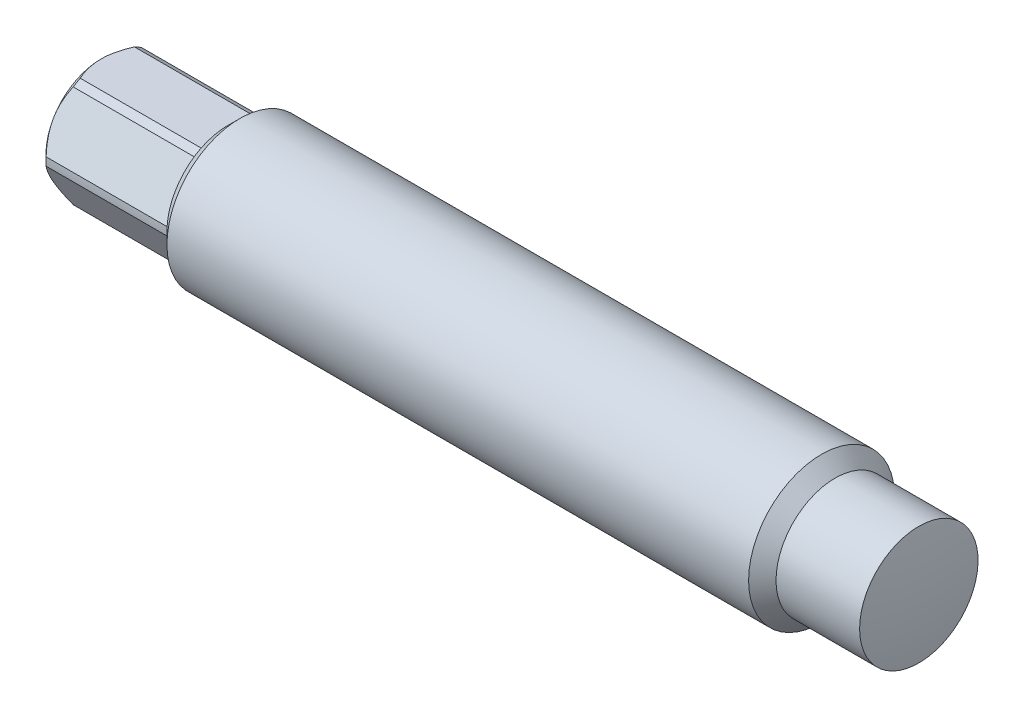
ISO-10303-21;
HEADER;
FILE_DESCRIPTION(('STEP AP214'),'2;1');
FILE_NAME('part.step','',(''),(''),'','','');
FILE_SCHEMA(('AUTOMOTIVE_DESIGN { 1 0 10303 214 1 1 1 1 }'));
ENDSEC;
DATA;
#1=APPLICATION_CONTEXT('core data for automotive mechanical design processes');
#2=APPLICATION_PROTOCOL_DEFINITION('international standard','automotive_design',2000,#1);
#3=PRODUCT_CONTEXT('',#1,'mechanical');
#4=PRODUCT('Part','Part','',(#3));
#5=PRODUCT_RELATED_PRODUCT_CATEGORY('part','',(#4));
#6=PRODUCT_DEFINITION_FORMATION('','',#4);
#7=PRODUCT_DEFINITION_CONTEXT('part definition',#1,'design');
#8=PRODUCT_DEFINITION('design','',#6,#7);
#9=PRODUCT_DEFINITION_SHAPE('','',#8);
#10=(LENGTH_UNIT() NAMED_UNIT(*) SI_UNIT(.MILLI.,.METRE.));
#11=(NAMED_UNIT(*) PLANE_ANGLE_UNIT() SI_UNIT($,.RADIAN.));
#12=(NAMED_UNIT(*) SI_UNIT($,.STERADIAN.) SOLID_ANGLE_UNIT());
#13=UNCERTAINTY_MEASURE_WITH_UNIT(LENGTH_MEASURE(1.E-05),#10,'distance_accuracy_value','');
#14=(GEOMETRIC_REPRESENTATION_CONTEXT(3) GLOBAL_UNCERTAINTY_ASSIGNED_CONTEXT((#13)) GLOBAL_UNIT_ASSIGNED_CONTEXT((#10,
#11,#12)) REPRESENTATION_CONTEXT('',''));
#15=CARTESIAN_POINT('',(0.,0.,0.));
#16=DIRECTION('',(0.,0.,1.));
#17=DIRECTION('',(1.,0.,0.));
#18=AXIS2_PLACEMENT_3D('',#15,#16,#17);
#19=CARTESIAN_POINT('',(0.,0.,0.));
#20=DIRECTION('',(-1.,0.,0.));
#21=DIRECTION('',(0.,0.,1.));
#22=AXIS2_PLACEMENT_3D('',#19,#20,#21);
#23=CYLINDRICAL_SURFACE('',#22,7.9629);
#24=DIRECTION('',(-1.,0.,0.));
#25=VECTOR('',#24,1.);
#26=CARTESIAN_POINT('',(0.,0.525408315359418,-7.94554733873955));
#27=LINE('',#26,#25);
#28=CARTESIAN_POINT('',(-90.17,0.525408315359418,-7.94554733873955));
#29=VERTEX_POINT('',#28);
#30=CARTESIAN_POINT('',(-105.86085,0.525408315359419,-7.94554733873955));
#31=VERTEX_POINT('',#30);
#32=EDGE_CURVE('E447',#29,#31,#27,.T.);
#33=ORIENTED_EDGE('',*,*,#32,.F.);
#34=CARTESIAN_POINT('',(-90.17,0.,0.));
#35=DIRECTION('',(-1.,0.,0.));
#36=DIRECTION('',(0.,0.,1.));
#37=AXIS2_PLACEMENT_3D('',#34,#35,#36);
#38=CIRCLE('',#37,7.9629);
#39=CARTESIAN_POINT('',(-90.17,-0.525408315359413,-7.94554733873955));
#40=VERTEX_POINT('',#39);
#41=EDGE_CURVE('E559',#29,#40,#38,.T.);
#42=ORIENTED_EDGE('',*,*,#41,.T.);
#43=DIRECTION('',(-1.,0.,0.));
#44=VECTOR('',#43,1.);
#45=CARTESIAN_POINT('',(0.,-0.525408315359413,-7.94554733873955));
#46=LINE('',#45,#44);
#47=CARTESIAN_POINT('',(-105.86085,-0.525408315359416,-7.94554733873955));
#48=VERTEX_POINT('',#47);
#49=EDGE_CURVE('E405',#48,#40,#46,.F.);
#50=ORIENTED_EDGE('',*,*,#49,.F.);
#51=CARTESIAN_POINT('',(-105.86085,0.,0.));
#52=DIRECTION('',(-1.,0.,0.));
#53=DIRECTION('',(0.,0.,1.));
#54=AXIS2_PLACEMENT_3D('',#51,#52,#53);
#55=CIRCLE('',#54,7.9629);
#56=EDGE_CURVE('E487',#31,#48,#55,.T.);
#57=ORIENTED_EDGE('',*,*,#56,.F.);
#58=EDGE_LOOP('',(#33,#42,#50,#57));
#59=FACE_BOUND('',#58,.T.);
#60=ADVANCED_FACE('F140',(#59),#23,.T.);
#61=DIRECTION('',(-1.,0.,0.));
#62=VECTOR('',#61,1.);
#63=CARTESIAN_POINT('',(0.,6.61834168464059,-4.42779061783062));
#64=LINE('',#63,#62);
#65=CARTESIAN_POINT('',(-105.86085,6.61834168464058,-4.42779061783062));
#66=VERTEX_POINT('',#65);
#67=CARTESIAN_POINT('',(-90.17,6.61834168464059,-4.42779061783061));
#68=VERTEX_POINT('',#67);
#69=EDGE_CURVE('E444',#66,#68,#64,.F.);
#70=ORIENTED_EDGE('',*,*,#69,.F.);
#71=CARTESIAN_POINT('',(-105.86085,7.14375,-3.51775672090893));
#72=VERTEX_POINT('',#71);
#73=EDGE_CURVE('E591',#72,#66,#55,.T.);
#74=ORIENTED_EDGE('',*,*,#73,.F.);
#75=DIRECTION('',(-1.,0.,0.));
#76=VECTOR('',#75,1.);
#77=CARTESIAN_POINT('',(0.,7.14375,-3.51775672090893));
#78=LINE('',#77,#76);
#79=CARTESIAN_POINT('',(-90.17,7.14375,-3.51775672090893));
#80=VERTEX_POINT('',#79);
#81=EDGE_CURVE('E507',#80,#72,#78,.T.);
#82=ORIENTED_EDGE('',*,*,#81,.F.);
#83=EDGE_CURVE('E320',#80,#68,#38,.T.);
#84=ORIENTED_EDGE('',*,*,#83,.T.);
#85=EDGE_LOOP('',(#70,#74,#82,#84));
#86=FACE_BOUND('',#85,.T.);
#87=ADVANCED_FACE('F262',(#86),#23,.T.);
#88=DIRECTION('',(-1.,0.,0.));
#89=VECTOR('',#88,1.);
#90=CARTESIAN_POINT('',(0.,-6.61834168464058,-4.42779061783062));
#91=LINE('',#90,#89);
#92=CARTESIAN_POINT('',(-90.17,-6.61834168464058,-4.42779061783062));
#93=VERTEX_POINT('',#92);
#94=CARTESIAN_POINT('',(-105.86085,-6.61834168464058,-4.42779061783062));
#95=VERTEX_POINT('',#94);
#96=EDGE_CURVE('E443',#93,#95,#91,.T.);
#97=ORIENTED_EDGE('',*,*,#96,.F.);
#98=CARTESIAN_POINT('',(-90.17,-7.14375,-3.51775672090893));
#99=VERTEX_POINT('',#98);
#100=EDGE_CURVE('E560',#93,#99,#38,.T.);
#101=ORIENTED_EDGE('',*,*,#100,.T.);
#102=DIRECTION('',(-1.,0.,0.));
#103=VECTOR('',#102,1.);
#104=CARTESIAN_POINT('',(0.,-7.14375,-3.51775672090893));
#105=LINE('',#104,#103);
#106=CARTESIAN_POINT('',(-105.86085,-7.14375,-3.51775672090893));
#107=VERTEX_POINT('',#106);
#108=EDGE_CURVE('E600',#107,#99,#105,.F.);
#109=ORIENTED_EDGE('',*,*,#108,.F.);
#110=EDGE_CURVE('E494',#95,#107,#55,.T.);
#111=ORIENTED_EDGE('',*,*,#110,.F.);
#112=EDGE_LOOP('',(#97,#101,#109,#111));
#113=FACE_BOUND('',#112,.T.);
#114=ADVANCED_FACE('F269',(#113),#23,.T.);
#115=DIRECTION('',(-1.,0.,0.));
#116=VECTOR('',#115,1.);
#117=CARTESIAN_POINT('',(0.,-7.14375,3.51775672090893));
#118=LINE('',#117,#116);
#119=CARTESIAN_POINT('',(-90.17,-7.14375,3.51775672090893));
#120=VERTEX_POINT('',#119);
#121=CARTESIAN_POINT('',(-105.86085,-7.14375,3.51775672090893));
#122=VERTEX_POINT('',#121);
#123=EDGE_CURVE('E404',#120,#122,#118,.T.);
#124=ORIENTED_EDGE('',*,*,#123,.F.);
#125=CARTESIAN_POINT('',(-90.17,-6.61834168464058,4.42779061783062));
#126=VERTEX_POINT('',#125);
#127=EDGE_CURVE('E572',#120,#126,#38,.T.);
#128=ORIENTED_EDGE('',*,*,#127,.T.);
#129=DIRECTION('',(-1.,0.,0.));
#130=VECTOR('',#129,1.);
#131=CARTESIAN_POINT('',(0.,-6.61834168464059,4.42779061783061));
#132=LINE('',#131,#130);
#133=CARTESIAN_POINT('',(-105.86085,-6.61834168464058,4.42779061783062));
#134=VERTEX_POINT('',#133);
#135=EDGE_CURVE('E609',#134,#126,#132,.F.);
#136=ORIENTED_EDGE('',*,*,#135,.F.);
#137=EDGE_CURVE('E462',#122,#134,#55,.T.);
#138=ORIENTED_EDGE('',*,*,#137,.F.);
#139=EDGE_LOOP('',(#124,#128,#136,#138));
#140=FACE_BOUND('',#139,.T.);
#141=ADVANCED_FACE('F285',(#140),#23,.T.);
#142=DIRECTION('',(-1.,0.,0.));
#143=VECTOR('',#142,1.);
#144=CARTESIAN_POINT('',(0.,-0.52540831535942,7.94554733873955));
#145=LINE('',#144,#143);
#146=CARTESIAN_POINT('',(-90.17,-0.52540831535942,7.94554733873955));
#147=VERTEX_POINT('',#146);
#148=CARTESIAN_POINT('',(-105.86085,-0.525408315359425,7.94554733873955));
#149=VERTEX_POINT('',#148);
#150=EDGE_CURVE('E497',#147,#149,#145,.T.);
#151=ORIENTED_EDGE('',*,*,#150,.F.);
#152=CARTESIAN_POINT('',(-90.17,0.525408315359412,7.94554733873955));
#153=VERTEX_POINT('',#152);
#154=EDGE_CURVE('E318',#147,#153,#38,.T.);
#155=ORIENTED_EDGE('',*,*,#154,.T.);
#156=DIRECTION('',(-1.,0.,0.));
#157=VECTOR('',#156,1.);
#158=CARTESIAN_POINT('',(0.,0.525408315359413,7.94554733873955));
#159=LINE('',#158,#157);
#160=CARTESIAN_POINT('',(-105.86085,0.525408315359416,7.94554733873955));
#161=VERTEX_POINT('',#160);
#162=EDGE_CURVE('E301',#161,#153,#159,.F.);
#163=ORIENTED_EDGE('',*,*,#162,.F.);
#164=EDGE_CURVE('E323',#149,#161,#55,.T.);
#165=ORIENTED_EDGE('',*,*,#164,.F.);
#166=EDGE_LOOP('',(#151,#155,#163,#165));
#167=FACE_BOUND('',#166,.T.);
#168=ADVANCED_FACE('F276',(#167),#23,.T.);
#169=DIRECTION('',(-1.,0.,0.));
#170=VECTOR('',#169,1.);
#171=CARTESIAN_POINT('',(0.,6.61834168464058,4.42779061783062));
#172=LINE('',#171,#170);
#173=CARTESIAN_POINT('',(-90.17,6.61834168464058,4.42779061783062));
#174=VERTEX_POINT('',#173);
#175=CARTESIAN_POINT('',(-105.86085,6.61834168464058,4.42779061783062));
#176=VERTEX_POINT('',#175);
#177=EDGE_CURVE('E290',#174,#176,#172,.T.);
#178=ORIENTED_EDGE('',*,*,#177,.F.);
#179=CARTESIAN_POINT('',(-90.17,7.14375,3.51775672090894));
#180=VERTEX_POINT('',#179);
#181=EDGE_CURVE('E293',#174,#180,#38,.T.);
#182=ORIENTED_EDGE('',*,*,#181,.T.);
#183=DIRECTION('',(-1.,0.,0.));
#184=VECTOR('',#183,1.);
#185=CARTESIAN_POINT('',(0.,7.14375,3.51775672090894));
#186=LINE('',#185,#184);
#187=CARTESIAN_POINT('',(-105.86085,7.14375,3.51775672090893));
#188=VERTEX_POINT('',#187);
#189=EDGE_CURVE('E510',#188,#180,#186,.F.);
#190=ORIENTED_EDGE('',*,*,#189,.F.);
#191=EDGE_CURVE('E295',#176,#188,#55,.T.);
#192=ORIENTED_EDGE('',*,*,#191,.F.);
#193=EDGE_LOOP('',(#178,#182,#190,#192));
#194=FACE_BOUND('',#193,.T.);
#195=ADVANCED_FACE('F265',(#194),#23,.T.);
#196=CARTESIAN_POINT('',(-105.86085,0.,0.));
#197=DIRECTION('',(1.,0.,0.));
#198=DIRECTION('',(0.,0.,-1.));
#199=AXIS2_PLACEMENT_3D('',#196,#197,#198);
#200=CONICAL_SURFACE('',#199,7.9629,0.785398163397461);
#201=CARTESIAN_POINT('',(-105.86065,0.525016263428014,-7.94577369002768));
#202=CARTESIAN_POINT('',(-105.971804415198,0.742930623682568,-7.81996077547443));
#203=CARTESIAN_POINT('',(-106.075105204488,0.964184339123071,-7.69221988330565));
#204=CARTESIAN_POINT('',(-106.261743657902,1.41379841676234,-7.43263507454918));
#205=CARTESIAN_POINT('',(-106.345005757468,1.64218212022255,-7.3007776818779));
#206=CARTESIAN_POINT('',(-106.485597433242,2.10217965773807,-7.03519797976675));
#207=CARTESIAN_POINT('',(-106.543216246783,2.33372542458197,-6.9015149689497));
#208=CARTESIAN_POINT('',(-106.629593957802,2.80054908186164,-6.6319942047552));
#209=CARTESIAN_POINT('',(-106.65839712059,3.03582068225016,-6.49616008293822));
#210=CARTESIAN_POINT('',(-106.683921072651,3.49195676739485,-6.23280979139283));
#211=CARTESIAN_POINT('',(-106.682652186831,3.71273636675249,-6.10534263027212));
#212=CARTESIAN_POINT('',(-106.653044689095,4.15301733098721,-5.85114629705213));
#213=CARTESIAN_POINT('',(-106.624692243303,4.37251798494867,-5.72441753540018));
#214=CARTESIAN_POINT('',(-106.543055697869,4.80787693861962,-5.47306292630415));
#215=CARTESIAN_POINT('',(-106.48977788479,5.02373614254429,-5.34843655681118));
#216=CARTESIAN_POINT('',(-106.361670596268,5.45060888959126,-5.1019814613939));
#217=CARTESIAN_POINT('',(-106.286833918402,5.66162078783759,-4.98015368513917));
#218=CARTESIAN_POINT('',(-106.152029193113,5.99691143466546,-4.78657353993633));
#219=CARTESIAN_POINT('',(-106.097647524188,6.12291675321138,-4.71382433535452));
#220=CARTESIAN_POINT('',(-105.983222419549,6.37251397608516,-4.56971931153936));
#221=CARTESIAN_POINT('',(-105.923198000013,6.49611240394659,-4.49835972594215));
#222=CARTESIAN_POINT('',(-105.86065,6.61873373657199,-4.42756426654248));
#223=B_SPLINE_CURVE_WITH_KNOTS('',3,(#201,#202,#203,#204,#205,#206,#207,#208,#209,#210,#211,
#212,#213,#214,#215,#216,#217,#218,#219,#220,#221,#222),.UNSPECIFIED.,.F.,.F.,(4,2,2,2,2,2,2,2,
2,2,4),(0.,0.825650289024538,1.65436690781132,2.47348340243982,3.29133966599778,
4.05468625055734,4.81842294969002,5.58196712639048,6.34576668564924,6.81164078022065,
7.2759976065092),.UNSPECIFIED.);
#224=CARTESIAN_POINT('',(-106.68,3.571875,-6.18666897828508));
#225=VERTEX_POINT('',#224);
#226=EDGE_CURVE('E442',#31,#225,#223,.T.);
#227=ORIENTED_EDGE('',*,*,#226,.F.);
#228=ORIENTED_EDGE('',*,*,#56,.T.);
#229=CARTESIAN_POINT('',(-105.86065,-6.61873373657199,-4.42756426654249));
#230=CARTESIAN_POINT('',(-105.971804415198,-6.40081937631743,-4.55337718109574));
#231=CARTESIAN_POINT('',(-106.075105204488,-6.17956566087693,-4.68111807326452));
#232=CARTESIAN_POINT('',(-106.261743657902,-5.72995158323766,-4.94070288202099));
#233=CARTESIAN_POINT('',(-106.345005757468,-5.50156787977744,-5.07256027469227));
#234=CARTESIAN_POINT('',(-106.485597433242,-5.04157034226193,-5.33813997680342));
#235=CARTESIAN_POINT('',(-106.543216246783,-4.81002457541803,-5.47182298762046));
#236=CARTESIAN_POINT('',(-106.629593957802,-4.34320091813836,-5.74134375181496));
#237=CARTESIAN_POINT('',(-106.65839712059,-4.10792931774985,-5.87717787363195));
#238=CARTESIAN_POINT('',(-106.683921072651,-3.65179323260515,-6.14052816517734));
#239=CARTESIAN_POINT('',(-106.682652186831,-3.43101363324751,-6.26799532629805));
#240=CARTESIAN_POINT('',(-106.653044689095,-2.99073266901279,-6.52219165951803));
#241=CARTESIAN_POINT('',(-106.624692243303,-2.77123201505133,-6.64892042116998));
#242=CARTESIAN_POINT('',(-106.543055697869,-2.33587306138038,-6.90027503026602));
#243=CARTESIAN_POINT('',(-106.48977788479,-2.12001385745571,-7.02490139975899));
#244=CARTESIAN_POINT('',(-106.361670596268,-1.69314111040874,-7.27135649517627));
#245=CARTESIAN_POINT('',(-106.286833918402,-1.48212921216241,-7.393184271431));
#246=CARTESIAN_POINT('',(-106.152029193113,-1.14683856533454,-7.58676441663384));
#247=CARTESIAN_POINT('',(-106.097647524188,-1.02083324678862,-7.65951362121565));
#248=CARTESIAN_POINT('',(-105.983222419549,-0.771236023914839,-7.80361864503081));
#249=CARTESIAN_POINT('',(-105.923198000013,-0.647637596053409,-7.87497823062802));
#250=CARTESIAN_POINT('',(-105.86065,-0.525016263428011,-7.94577369002768));
#251=B_SPLINE_CURVE_WITH_KNOTS('',3,(#229,#230,#231,#232,#233,#234,#235,#236,#237,#238,#239,
#240,#241,#242,#243,#244,#245,#246,#247,#248,#249,#250),.UNSPECIFIED.,.F.,.F.,(4,2,2,2,2,2,2,2,
2,2,4),(0.,0.825650289024538,1.65436690781132,2.47348340243982,3.29133966599777,
4.05468625055733,4.81842294969001,5.58196712639047,6.34576668564924,6.81164078022065,
7.2759976065092),.UNSPECIFIED.);
#252=CARTESIAN_POINT('',(-106.68,-3.571875,-6.18666897828509));
#253=VERTEX_POINT('',#252);
#254=EDGE_CURVE('E395',#253,#48,#251,.T.);
#255=ORIENTED_EDGE('',*,*,#254,.F.);
#256=CARTESIAN_POINT('',(-106.68,0.,0.));
#257=DIRECTION('',(-1.,0.,0.));
#258=DIRECTION('',(0.,0.,1.));
#259=AXIS2_PLACEMENT_3D('',#256,#257,#258);
#260=CIRCLE('',#259,7.14375);
#261=EDGE_CURVE('E464',#225,#253,#260,.T.);
#262=ORIENTED_EDGE('',*,*,#261,.F.);
#263=EDGE_LOOP('',(#227,#228,#255,#262));
#264=FACE_BOUND('',#263,.T.);
#265=ADVANCED_FACE('F275',(#264),#200,.T.);
#266=EDGE_CURVE('E436',#225,#66,#223,.T.);
#267=ORIENTED_EDGE('',*,*,#266,.F.);
#268=CARTESIAN_POINT('',(-106.68,7.14375,0.));
#269=VERTEX_POINT('',#268);
#270=EDGE_CURVE('E453',#269,#225,#260,.T.);
#271=ORIENTED_EDGE('',*,*,#270,.F.);
#272=CARTESIAN_POINT('',(-102.726299392836,7.14375,-8.49236397688784));
#273=CARTESIAN_POINT('',(-102.883617338796,7.14375,-8.28674139122919));
#274=CARTESIAN_POINT('',(-103.039493475246,7.14375,-8.07999790427711));
#275=CARTESIAN_POINT('',(-103.347707304941,7.14375,-7.66381570002558));
#276=CARTESIAN_POINT('',(-103.500044137052,7.14375,-7.45437634567462));
#277=CARTESIAN_POINT('',(-103.801608790406,7.14375,-7.03081738792425));
#278=CARTESIAN_POINT('',(-103.950803489898,7.14375,-6.81667412436506));
#279=CARTESIAN_POINT('',(-104.243891616,7.14375,-6.38480162656461));
#280=CARTESIAN_POINT('',(-104.387785410254,7.14375,-6.16707264253182));
#281=CARTESIAN_POINT('',(-104.677724037695,7.14375,-5.71391329627827));
#282=CARTESIAN_POINT('',(-104.823356737556,7.14375,-5.4782179098306));
#283=CARTESIAN_POINT('',(-105.105425465621,7.14375,-5.00130040543057));
#284=CARTESIAN_POINT('',(-105.241859973077,7.14375,-4.76007738237876));
#285=CARTESIAN_POINT('',(-105.502615120606,7.14375,-4.27206494883061));
#286=CARTESIAN_POINT('',(-105.626971349768,7.14375,-4.02529470427702));
#287=CARTESIAN_POINT('',(-105.860784253999,7.14375,-3.52484984602448));
#288=CARTESIAN_POINT('',(-105.970247875142,7.14375,-3.27117851777284));
#289=CARTESIAN_POINT('',(-106.160980925681,7.14375,-2.78047536178263));
#290=CARTESIAN_POINT('',(-106.243928874919,7.14375,-2.54410269811936));
#291=CARTESIAN_POINT('',(-106.390893815781,7.14375,-2.06543348056348));
#292=CARTESIAN_POINT('',(-106.454909574167,7.14375,-1.82313654187762));
#293=CARTESIAN_POINT('',(-106.559516333783,7.14375,-1.33822768036744));
#294=CARTESIAN_POINT('',(-106.600525477284,7.14375,-1.09570748832519));
#295=CARTESIAN_POINT('',(-106.658280246525,7.14375,-0.607779158346964));
#296=CARTESIAN_POINT('',(-106.6750306344,7.14375,-0.362371596756799));
#297=CARTESIAN_POINT('',(-106.682895179625,7.14375,0.118700703890408));
#298=CARTESIAN_POINT('',(-106.675040482563,7.14375,0.354348823766971));
#299=CARTESIAN_POINT('',(-106.636470444818,7.14375,0.823754077859267));
#300=CARTESIAN_POINT('',(-106.605752981671,7.14375,1.0575110344722));
#301=CARTESIAN_POINT('',(-106.522653787919,7.14375,1.52540023600976));
#302=CARTESIAN_POINT('',(-106.469893761324,7.14375,1.75946416527905));
#303=CARTESIAN_POINT('',(-106.345602372319,7.14375,2.22245527996901));
#304=CARTESIAN_POINT('',(-106.274072231029,7.14375,2.45138279849576));
#305=CARTESIAN_POINT('',(-106.109955685496,7.14375,2.91901149489557));
#306=CARTESIAN_POINT('',(-106.016270341144,7.14375,3.15732272502102));
#307=CARTESIAN_POINT('',(-105.81444916461,7.14375,3.62779989607413));
#308=CARTESIAN_POINT('',(-105.706306757059,7.14375,3.85996298279215));
#309=CARTESIAN_POINT('',(-105.478137998848,7.14375,4.31925043476694));
#310=CARTESIAN_POINT('',(-105.358074843476,7.14375,4.54635636666597));
#311=CARTESIAN_POINT('',(-105.108709892512,7.14375,4.99535840255166));
#312=CARTESIAN_POINT('',(-104.979409532092,7.14375,5.21725530877127));
#313=CARTESIAN_POINT('',(-104.719957364376,7.14375,5.64565874179973));
#314=CARTESIAN_POINT('',(-104.590164125865,7.14375,5.85238358016881));
#315=CARTESIAN_POINT('',(-104.32507005428,7.14375,6.26228218078482));
#316=CARTESIAN_POINT('',(-104.189768807037,7.14375,6.46545567434368));
#317=CARTESIAN_POINT('',(-103.915747385072,7.14375,6.86707880546117));
#318=CARTESIAN_POINT('',(-103.777063527275,7.14375,7.06555331083476));
#319=CARTESIAN_POINT('',(-103.49599105997,7.14375,7.4597821335156));
#320=CARTESIAN_POINT('',(-103.353603481768,7.14375,7.65553718525368));
#321=CARTESIAN_POINT('',(-103.209700334836,7.14375,7.85015198783304));
#322=B_SPLINE_CURVE_WITH_KNOTS('',3,(#272,#273,#274,#275,#276,#277,#278,#279,#280,#281,#282,
#283,#284,#285,#286,#287,#288,#289,#290,#291,#292,#293,#294,#295,#296,#297,#298,#299,#300,#301,
#302,#303,#304,#305,#306,#307,#308,#309,#310,#311,#312,#313,#314,#315,#316,#317,#318,#319,#320,
#321),.UNSPECIFIED.,.F.,.F.,(4,2,2,2,2,2,2,2,2,2,2,2,2,2,2,2,2,2,2,2,2,2,2,2,4),(0.,
0.776716744527418,1.55362053082313,2.33652786832875,3.11938080478742,3.95038825490385,
4.78153276109287,5.61014883456512,6.43837709783569,7.18923870385181,7.94014921003845,
8.67692892985789,9.41356399590167,10.1197474747915,10.8259965203448,11.5448993680387,
12.2637554579541,13.0313587325021,13.799312324197,14.5697153723541,15.3399989831765,
16.0721759070361,16.8044079883228,17.5307421089012,18.2568761012589),.UNSPECIFIED.);
#323=EDGE_CURVE('E516',#72,#269,#322,.T.);
#324=ORIENTED_EDGE('',*,*,#323,.F.);
#325=ORIENTED_EDGE('',*,*,#73,.T.);
#326=EDGE_LOOP('',(#267,#271,#324,#325));
#327=FACE_BOUND('',#326,.T.);
#328=ADVANCED_FACE('F282',(#327),#200,.T.);
#329=EDGE_CURVE('E403',#95,#253,#251,.T.);
#330=ORIENTED_EDGE('',*,*,#329,.F.);
#331=ORIENTED_EDGE('',*,*,#110,.T.);
#332=CARTESIAN_POINT('',(-102.726299392836,-7.14375,-8.49236397688784));
#333=CARTESIAN_POINT('',(-102.883617338796,-7.14375,-8.28674139122919));
#334=CARTESIAN_POINT('',(-103.039493475246,-7.14375,-8.0799979042771));
#335=CARTESIAN_POINT('',(-103.347707304941,-7.14375,-7.66381570002557));
#336=CARTESIAN_POINT('',(-103.500044137052,-7.14375,-7.45437634567462));
#337=CARTESIAN_POINT('',(-103.801608790406,-7.14375,-7.03081738792425));
#338=CARTESIAN_POINT('',(-103.950803489898,-7.14375,-6.81667412436505));
#339=CARTESIAN_POINT('',(-104.243891616,-7.14375,-6.38480162656461));
#340=CARTESIAN_POINT('',(-104.387785410254,-7.14375,-6.16707264253182));
#341=CARTESIAN_POINT('',(-104.677724037695,-7.14375,-5.71391329627827));
#342=CARTESIAN_POINT('',(-104.823356737556,-7.14375,-5.47821790983061));
#343=CARTESIAN_POINT('',(-105.105425465621,-7.14375,-5.00130040543057));
#344=CARTESIAN_POINT('',(-105.241859973077,-7.14375,-4.76007738237876));
#345=CARTESIAN_POINT('',(-105.502615120606,-7.14375,-4.2720649488306));
#346=CARTESIAN_POINT('',(-105.626971349768,-7.14375,-4.02529470427702));
#347=CARTESIAN_POINT('',(-105.860784253999,-7.14375,-3.52484984602447));
#348=CARTESIAN_POINT('',(-105.970247875142,-7.14375,-3.27117851777284));
#349=CARTESIAN_POINT('',(-106.160980925681,-7.14375,-2.78047536178263));
#350=CARTESIAN_POINT('',(-106.243928874919,-7.14375,-2.54410269811936));
#351=CARTESIAN_POINT('',(-106.390893815781,-7.14375,-2.06543348056348));
#352=CARTESIAN_POINT('',(-106.454909574167,-7.14375,-1.82313654187761));
#353=CARTESIAN_POINT('',(-106.559516333783,-7.14375,-1.33822768036744));
#354=CARTESIAN_POINT('',(-106.600525477284,-7.14375,-1.09570748832519));
#355=CARTESIAN_POINT('',(-106.658280246525,-7.14375,-0.607779158346961));
#356=CARTESIAN_POINT('',(-106.6750306344,-7.14375,-0.362371596756795));
#357=CARTESIAN_POINT('',(-106.682895179625,-7.14375,0.118700703890413));
#358=CARTESIAN_POINT('',(-106.675040482563,-7.14375,0.354348823766977));
#359=CARTESIAN_POINT('',(-106.636470444818,-7.14375,0.823754077859274));
#360=CARTESIAN_POINT('',(-106.605752981671,-7.14375,1.05751103447221));
#361=CARTESIAN_POINT('',(-106.522653787919,-7.14375,1.52540023600977));
#362=CARTESIAN_POINT('',(-106.469893761324,-7.14375,1.75946416527906));
#363=CARTESIAN_POINT('',(-106.345602372319,-7.14375,2.22245527996901));
#364=CARTESIAN_POINT('',(-106.274072231029,-7.14375,2.45138279849576));
#365=CARTESIAN_POINT('',(-106.109955685496,-7.14375,2.91901149489558));
#366=CARTESIAN_POINT('',(-106.016270341144,-7.14375,3.15732272502104));
#367=CARTESIAN_POINT('',(-105.81444916461,-7.14375,3.62779989607415));
#368=CARTESIAN_POINT('',(-105.706306757059,-7.14375,3.85996298279217));
#369=CARTESIAN_POINT('',(-105.478137998848,-7.14375,4.31925043476697));
#370=CARTESIAN_POINT('',(-105.358074843476,-7.14375,4.546356366666));
#371=CARTESIAN_POINT('',(-105.108709892512,-7.14375,4.99535840255168));
#372=CARTESIAN_POINT('',(-104.979409532092,-7.14375,5.21725530877129));
#373=CARTESIAN_POINT('',(-104.719957364376,-7.14375,5.64565874179975));
#374=CARTESIAN_POINT('',(-104.590164125864,-7.14375,5.85238358016883));
#375=CARTESIAN_POINT('',(-104.32507005428,-7.14375,6.26228218078484));
#376=CARTESIAN_POINT('',(-104.189768807037,-7.14375,6.4654556743437));
#377=CARTESIAN_POINT('',(-103.915747385072,-7.14375,6.86707880546119));
#378=CARTESIAN_POINT('',(-103.777063527275,-7.14375,7.06555331083478));
#379=CARTESIAN_POINT('',(-103.49599105997,-7.14375,7.45978213351561));
#380=CARTESIAN_POINT('',(-103.353603481768,-7.14375,7.65553718525369));
#381=CARTESIAN_POINT('',(-103.209700334836,-7.14375,7.85015198783305));
#382=B_SPLINE_CURVE_WITH_KNOTS('',3,(#332,#333,#334,#335,#336,#337,#338,#339,#340,#341,#342,
#343,#344,#345,#346,#347,#348,#349,#350,#351,#352,#353,#354,#355,#356,#357,#358,#359,#360,#361,
#362,#363,#364,#365,#366,#367,#368,#369,#370,#371,#372,#373,#374,#375,#376,#377,#378,#379,#380,
#381),.UNSPECIFIED.,.F.,.F.,(4,2,2,2,2,2,2,2,2,2,2,2,2,2,2,2,2,2,2,2,2,2,2,2,4),(0.,
0.77671674452743,1.55362053082313,2.33652786832875,3.11938080478742,3.95038825490385,
4.78153276109287,5.61014883456513,6.43837709783569,7.18923870385181,7.94014921003845,
8.67692892985789,9.41356399590167,10.1197474747915,10.8259965203448,11.5448993680387,
12.2637554579541,13.0313587325021,13.799312324197,14.5697153723541,15.3399989831765,
16.0721759070361,16.8044079883229,17.5307421089012,18.2568761012589),.UNSPECIFIED.);
#383=CARTESIAN_POINT('',(-106.68,-7.14375,0.));
#384=VERTEX_POINT('',#383);
#385=EDGE_CURVE('E387',#384,#107,#382,.F.);
#386=ORIENTED_EDGE('',*,*,#385,.F.);
#387=EDGE_CURVE('E472',#253,#384,#260,.T.);
#388=ORIENTED_EDGE('',*,*,#387,.F.);
#389=EDGE_LOOP('',(#330,#331,#386,#388));
#390=FACE_BOUND('',#389,.T.);
#391=ADVANCED_FACE('F491',(#390),#200,.T.);
#392=EDGE_CURVE('E164',#122,#384,#382,.F.);
#393=ORIENTED_EDGE('',*,*,#392,.F.);
#394=ORIENTED_EDGE('',*,*,#137,.T.);
#395=CARTESIAN_POINT('',(-105.86065,-0.525016263428019,7.94577369002768));
#396=CARTESIAN_POINT('',(-105.971804415198,-0.742930623682575,7.81996077547443));
#397=CARTESIAN_POINT('',(-106.075105204488,-0.964184339123077,7.69221988330565));
#398=CARTESIAN_POINT('',(-106.261743657902,-1.41379841676234,7.43263507454918));
#399=CARTESIAN_POINT('',(-106.345005757468,-1.64218212022256,7.3007776818779));
#400=CARTESIAN_POINT('',(-106.485597433242,-2.10217965773807,7.03519797976675));
#401=CARTESIAN_POINT('',(-106.543216246783,-2.33372542458197,6.90151496894971));
#402=CARTESIAN_POINT('',(-106.629593957802,-2.80054908186164,6.6319942047552));
#403=CARTESIAN_POINT('',(-106.65839712059,-3.03582068225016,6.49616008293822));
#404=CARTESIAN_POINT('',(-106.683921072651,-3.49195676739485,6.23280979139283));
#405=CARTESIAN_POINT('',(-106.682652186831,-3.71273636675249,6.10534263027212));
#406=CARTESIAN_POINT('',(-106.653044689095,-4.15301733098721,5.85114629705213));
#407=CARTESIAN_POINT('',(-106.624692243303,-4.37251798494867,5.72441753540018));
#408=CARTESIAN_POINT('',(-106.543055697869,-4.80787693861962,5.47306292630415));
#409=CARTESIAN_POINT('',(-106.48977788479,-5.02373614254429,5.34843655681118));
#410=CARTESIAN_POINT('',(-106.361670596268,-5.45060888959126,5.1019814613939));
#411=CARTESIAN_POINT('',(-106.286833918402,-5.66162078783759,4.98015368513917));
#412=CARTESIAN_POINT('',(-106.152029193113,-5.99691143466546,4.78657353993633));
#413=CARTESIAN_POINT('',(-106.097647524188,-6.12291675321138,4.71382433535452));
#414=CARTESIAN_POINT('',(-105.983222419549,-6.37251397608516,4.56971931153936));
#415=CARTESIAN_POINT('',(-105.923198000013,-6.49611240394659,4.49835972594215));
#416=CARTESIAN_POINT('',(-105.86065,-6.61873373657199,4.42756426654248));
#417=B_SPLINE_CURVE_WITH_KNOTS('',3,(#395,#396,#397,#398,#399,#400,#401,#402,#403,#404,#405,
#406,#407,#408,#409,#410,#411,#412,#413,#414,#415,#416),.UNSPECIFIED.,.F.,.F.,(4,2,2,2,2,2,2,2,
2,2,4),(0.,0.825650289024539,1.65436690781131,2.47348340243981,3.29133966599777,
4.05468625055733,4.81842294969001,5.58196712639047,6.34576668564923,6.81164078022065,
7.27599760650919),.UNSPECIFIED.);
#418=CARTESIAN_POINT('',(-106.68,-3.571875,6.18666897828509));
#419=VERTEX_POINT('',#418);
#420=EDGE_CURVE('E300',#419,#134,#417,.T.);
#421=ORIENTED_EDGE('',*,*,#420,.F.);
#422=EDGE_CURVE('E466',#384,#419,#260,.T.);
#423=ORIENTED_EDGE('',*,*,#422,.F.);
#424=EDGE_LOOP('',(#393,#394,#421,#423));
#425=FACE_BOUND('',#424,.T.);
#426=ADVANCED_FACE('F352',(#425),#200,.T.);
#427=EDGE_CURVE('E156',#149,#419,#417,.T.);
#428=ORIENTED_EDGE('',*,*,#427,.F.);
#429=ORIENTED_EDGE('',*,*,#164,.T.);
#430=CARTESIAN_POINT('',(-105.86065,6.61873373657198,4.42756426654249));
#431=CARTESIAN_POINT('',(-105.971804415198,6.40081937631743,4.55337718109574));
#432=CARTESIAN_POINT('',(-106.075105204488,6.17956566087693,4.68111807326452));
#433=CARTESIAN_POINT('',(-106.261743657902,5.72995158323766,4.940702882021));
#434=CARTESIAN_POINT('',(-106.345005757468,5.50156787977744,5.07256027469228));
#435=CARTESIAN_POINT('',(-106.485597433242,5.04157034226193,5.33813997680342));
#436=CARTESIAN_POINT('',(-106.543216246783,4.81002457541803,5.47182298762046));
#437=CARTESIAN_POINT('',(-106.629593957802,4.34320091813836,5.74134375181497));
#438=CARTESIAN_POINT('',(-106.65839712059,4.10792931774985,5.87717787363195));
#439=CARTESIAN_POINT('',(-106.683921072651,3.65179323260515,6.14052816517734));
#440=CARTESIAN_POINT('',(-106.682652186831,3.43101363324751,6.26799532629805));
#441=CARTESIAN_POINT('',(-106.653044689095,2.99073266901279,6.52219165951803));
#442=CARTESIAN_POINT('',(-106.624692243303,2.77123201505133,6.64892042116998));
#443=CARTESIAN_POINT('',(-106.543055697869,2.33587306138038,6.90027503026602));
#444=CARTESIAN_POINT('',(-106.48977788479,2.12001385745571,7.02490139975899));
#445=CARTESIAN_POINT('',(-106.361670596268,1.69314111040874,7.27135649517627));
#446=CARTESIAN_POINT('',(-106.286833918402,1.48212921216241,7.393184271431));
#447=CARTESIAN_POINT('',(-106.152029193113,1.14683856533454,7.58676441663384));
#448=CARTESIAN_POINT('',(-106.097647524188,1.02083324678862,7.65951362121565));
#449=CARTESIAN_POINT('',(-105.983222419549,0.771236023914839,7.80361864503081));
#450=CARTESIAN_POINT('',(-105.923198000013,0.647637596053409,7.87497823062802));
#451=CARTESIAN_POINT('',(-105.86065,0.52501626342801,7.94577369002768));
#452=B_SPLINE_CURVE_WITH_KNOTS('',3,(#430,#431,#432,#433,#434,#435,#436,#437,#438,#439,#440,
#441,#442,#443,#444,#445,#446,#447,#448,#449,#450,#451),.UNSPECIFIED.,.F.,.F.,(4,2,2,2,2,2,2,2,
2,2,4),(0.,0.825650289024539,1.65436690781132,2.47348340243982,3.29133966599777,
4.05468625055733,4.81842294969001,5.58196712639047,6.34576668564924,6.81164078022065,
7.2759976065092),.UNSPECIFIED.);
#453=CARTESIAN_POINT('',(-106.68,3.571875,6.18666897828509));
#454=VERTEX_POINT('',#453);
#455=EDGE_CURVE('E372',#454,#161,#452,.T.);
#456=ORIENTED_EDGE('',*,*,#455,.F.);
#457=EDGE_CURVE('E449',#419,#454,#260,.T.);
#458=ORIENTED_EDGE('',*,*,#457,.F.);
#459=EDGE_LOOP('',(#428,#429,#456,#458));
#460=FACE_BOUND('',#459,.T.);
#461=ADVANCED_FACE('F347',(#460),#200,.T.);
#462=EDGE_CURVE('E506',#176,#454,#452,.T.);
#463=ORIENTED_EDGE('',*,*,#462,.F.);
#464=ORIENTED_EDGE('',*,*,#191,.T.);
#465=EDGE_CURVE('E361',#269,#188,#322,.T.);
#466=ORIENTED_EDGE('',*,*,#465,.F.);
#467=EDGE_CURVE('E450',#454,#269,#260,.T.);
#468=ORIENTED_EDGE('',*,*,#467,.F.);
#469=EDGE_LOOP('',(#463,#464,#466,#468));
#470=FACE_BOUND('',#469,.T.);
#471=ADVANCED_FACE('F284',(#470),#200,.T.);
#472=CARTESIAN_POINT('',(-50.8,0.,0.));
#473=DIRECTION('',(-1.,0.,0.));
#474=DIRECTION('',(0.,1.,0.));
#475=AXIS2_PLACEMENT_3D('',#472,#473,#474);
#476=SPHERICAL_SURFACE('',#475,50.8);
#477=CARTESIAN_POINT('',(-0.584426442088704,0.,0.));
#478=DIRECTION('',(-1.,0.,0.));
#479=DIRECTION('',(0.,0.,1.));
#480=AXIS2_PLACEMENT_3D('',#477,#478,#479);
#481=CIRCLE('',#480,7.6835);
#482=CARTESIAN_POINT('',(-0.584426442088704,0.,7.6835));
#483=VERTEX_POINT('',#482);
#484=EDGE_CURVE('E15',#483,#483,#481,.T.);
#485=ORIENTED_EDGE('',*,*,#484,.F.);
#486=EDGE_LOOP('',(#485));
#487=FACE_BOUND('',#486,.T.);
#488=ADVANCED_FACE('F142',(#487),#476,.T.);
#489=CARTESIAN_POINT('',(0.,0.,0.));
#490=DIRECTION('',(-1.,0.,0.));
#491=DIRECTION('',(0.,0.,1.));
#492=AXIS2_PLACEMENT_3D('',#489,#490,#491);
#493=CYLINDRICAL_SURFACE('',#492,7.6835);
#494=CARTESIAN_POINT('',(-11.43,0.,0.));
#495=DIRECTION('',(-1.,0.,0.));
#496=DIRECTION('',(0.,0.,1.));
#497=AXIS2_PLACEMENT_3D('',#494,#495,#496);
#498=CIRCLE('',#497,7.6835);
#499=CARTESIAN_POINT('',(-11.43,0.,7.6835));
#500=VERTEX_POINT('',#499);
#501=EDGE_CURVE('E149',#500,#500,#498,.T.);
#502=ORIENTED_EDGE('',*,*,#501,.F.);
#503=EDGE_LOOP('',(#502));
#504=FACE_BOUND('',#503,.T.);
#505=ORIENTED_EDGE('',*,*,#484,.T.);
#506=EDGE_LOOP('',(#505));
#507=FACE_BOUND('',#506,.T.);
#508=ADVANCED_FACE('F338',(#504,#507),#493,.T.);
#509=CARTESIAN_POINT('',(-11.43,0.,0.));
#510=DIRECTION('',(-1.,0.,0.));
#511=DIRECTION('',(0.,0.,1.));
#512=AXIS2_PLACEMENT_3D('',#509,#510,#511);
#513=CONICAL_SURFACE('',#512,7.6835,0.785398163397435);
#514=CARTESIAN_POINT('',(-13.208,0.,0.));
#515=DIRECTION('',(-1.,0.,0.));
#516=DIRECTION('',(0.,0.,1.));
#517=AXIS2_PLACEMENT_3D('',#514,#515,#516);
#518=CIRCLE('',#517,9.4615);
#519=CARTESIAN_POINT('',(-13.208,0.,9.4615));
#520=VERTEX_POINT('',#519);
#521=EDGE_CURVE('E328',#520,#520,#518,.T.);
#522=ORIENTED_EDGE('',*,*,#521,.F.);
#523=EDGE_LOOP('',(#522));
#524=FACE_BOUND('',#523,.T.);
#525=ORIENTED_EDGE('',*,*,#501,.T.);
#526=EDGE_LOOP('',(#525));
#527=FACE_BOUND('',#526,.T.);
#528=ADVANCED_FACE('F336',(#524,#527),#513,.T.);
#529=CARTESIAN_POINT('',(0.,0.,0.));
#530=DIRECTION('',(-1.,0.,0.));
#531=DIRECTION('',(0.,0.,1.));
#532=AXIS2_PLACEMENT_3D('',#529,#530,#531);
#533=CYLINDRICAL_SURFACE('',#532,9.46149999999999);
#534=CARTESIAN_POINT('',(-88.6714000000001,0.,0.));
#535=DIRECTION('',(-1.,0.,0.));
#536=DIRECTION('',(0.,0.,1.));
#537=AXIS2_PLACEMENT_3D('',#534,#535,#536);
#538=CIRCLE('',#537,9.46149999999999);
#539=CARTESIAN_POINT('',(-88.6714000000001,0.,9.46149999999999));
#540=VERTEX_POINT('',#539);
#541=EDGE_CURVE('E317',#540,#540,#538,.T.);
#542=ORIENTED_EDGE('',*,*,#541,.F.);
#543=EDGE_LOOP('',(#542));
#544=FACE_BOUND('',#543,.T.);
#545=ORIENTED_EDGE('',*,*,#521,.T.);
#546=EDGE_LOOP('',(#545));
#547=FACE_BOUND('',#546,.T.);
#548=ADVANCED_FACE('F811',(#544,#547),#533,.T.);
#549=CARTESIAN_POINT('',(-88.6714000000001,0.,0.));
#550=DIRECTION('',(1.,0.,0.));
#551=DIRECTION('',(0.,0.,-1.));
#552=AXIS2_PLACEMENT_3D('',#549,#550,#551);
#553=CONICAL_SURFACE('',#552,9.46149999999999,0.785398163397467);
#554=EDGE_CURVE('E309',#153,#174,#38,.T.);
#555=ORIENTED_EDGE('',*,*,#554,.F.);
#556=ORIENTED_EDGE('',*,*,#154,.F.);
#557=EDGE_CURVE('E578',#126,#147,#38,.T.);
#558=ORIENTED_EDGE('',*,*,#557,.F.);
#559=ORIENTED_EDGE('',*,*,#127,.F.);
#560=EDGE_CURVE('E566',#99,#120,#38,.T.);
#561=ORIENTED_EDGE('',*,*,#560,.F.);
#562=ORIENTED_EDGE('',*,*,#100,.F.);
#563=EDGE_CURVE('E558',#40,#93,#38,.T.);
#564=ORIENTED_EDGE('',*,*,#563,.F.);
#565=ORIENTED_EDGE('',*,*,#41,.F.);
#566=EDGE_CURVE('E563',#68,#29,#38,.T.);
#567=ORIENTED_EDGE('',*,*,#566,.F.);
#568=ORIENTED_EDGE('',*,*,#83,.F.);
#569=EDGE_CURVE('E311',#180,#80,#38,.T.);
#570=ORIENTED_EDGE('',*,*,#569,.F.);
#571=ORIENTED_EDGE('',*,*,#181,.F.);
#572=EDGE_LOOP('',(#555,#556,#558,#559,#561,#562,#564,#565,#567,#568,#570,#571));
#573=FACE_BOUND('',#572,.T.);
#574=ORIENTED_EDGE('',*,*,#541,.T.);
#575=EDGE_LOOP('',(#574));
#576=FACE_BOUND('',#575,.T.);
#577=ADVANCED_FACE('F306',(#573,#576),#553,.T.);
#578=CARTESIAN_POINT('',(-106.68,7.14375,0.));
#579=DIRECTION('',(1.,0.,0.));
#580=DIRECTION('',(0.,0.,-1.));
#581=AXIS2_PLACEMENT_3D('',#578,#579,#580);
#582=PLANE('',#581);
#583=CARTESIAN_POINT('',(-106.68,0.,0.));
#584=DIRECTION('',(1.,0.,0.));
#585=DIRECTION('',(0.,1.,0.));
#586=AXIS2_PLACEMENT_3D('',#583,#584,#585);
#587=CIRCLE('',#586,3.96875);
#588=CARTESIAN_POINT('',(-106.68,3.96875,0.));
#589=VERTEX_POINT('',#588);
#590=EDGE_CURVE('E548',#589,#589,#587,.T.);
#591=ORIENTED_EDGE('',*,*,#590,.T.);
#592=EDGE_LOOP('',(#591));
#593=FACE_BOUND('',#592,.T.);
#594=ORIENTED_EDGE('',*,*,#467,.T.);
#595=ORIENTED_EDGE('',*,*,#270,.T.);
#596=ORIENTED_EDGE('',*,*,#261,.T.);
#597=ORIENTED_EDGE('',*,*,#387,.T.);
#598=ORIENTED_EDGE('',*,*,#422,.T.);
#599=ORIENTED_EDGE('',*,*,#457,.T.);
#600=EDGE_LOOP('',(#594,#595,#596,#597,#598,#599));
#601=FACE_BOUND('',#600,.T.);
#602=ADVANCED_FACE('F356',(#593,#601),#582,.F.);
#603=CARTESIAN_POINT('',(-106.68,7.14375,-4.12444598552339));
#604=DIRECTION('',(0.,1.,0.));
#605=DIRECTION('',(0.,0.,1.));
#606=AXIS2_PLACEMENT_3D('',#603,#604,#605);
#607=PLANE('',#606);
#608=ORIENTED_EDGE('',*,*,#81,.T.);
#609=ORIENTED_EDGE('',*,*,#323,.T.);
#610=ORIENTED_EDGE('',*,*,#465,.T.);
#611=ORIENTED_EDGE('',*,*,#189,.T.);
#612=DIRECTION('',(0.,0.,1.));
#613=VECTOR('',#612,1.);
#614=CARTESIAN_POINT('',(-90.17,7.14375,-4.12444598552339));
#615=LINE('',#614,#613);
#616=EDGE_CURVE('E541',#80,#180,#615,.T.);
#617=ORIENTED_EDGE('',*,*,#616,.F.);
#618=EDGE_LOOP('',(#608,#609,#610,#611,#617));
#619=FACE_BOUND('',#618,.T.);
#620=ADVANCED_FACE('F426',(#619),#607,.T.);
#621=CARTESIAN_POINT('',(-90.17,0.,0.));
#622=DIRECTION('',(1.,0.,0.));
#623=DIRECTION('',(0.,0.,-1.));
#624=AXIS2_PLACEMENT_3D('',#621,#622,#623);
#625=PLANE('',#624);
#626=ORIENTED_EDGE('',*,*,#616,.T.);
#627=ORIENTED_EDGE('',*,*,#569,.T.);
#628=EDGE_LOOP('',(#626,#627));
#629=FACE_BOUND('',#628,.T.);
#630=ADVANCED_FACE('F425',(#629),#625,.F.);
#631=CARTESIAN_POINT('',(-106.68,7.14375,4.12444598552339));
#632=DIRECTION('',(0.,0.5,0.866025403784439));
#633=DIRECTION('',(0.,-0.866025403784439,0.5));
#634=AXIS2_PLACEMENT_3D('',#631,#632,#633);
#635=PLANE('',#634);
#636=ORIENTED_EDGE('',*,*,#177,.T.);
#637=ORIENTED_EDGE('',*,*,#462,.T.);
#638=ORIENTED_EDGE('',*,*,#455,.T.);
#639=ORIENTED_EDGE('',*,*,#162,.T.);
#640=DIRECTION('',(0.,-0.866025403784439,0.5));
#641=VECTOR('',#640,1.);
#642=CARTESIAN_POINT('',(-90.17,7.14375,4.12444598552339));
#643=LINE('',#642,#641);
#644=EDGE_CURVE('E537',#174,#153,#643,.T.);
#645=ORIENTED_EDGE('',*,*,#644,.F.);
#646=EDGE_LOOP('',(#636,#637,#638,#639,#645));
#647=FACE_BOUND('',#646,.T.);
#648=ADVANCED_FACE('F422',(#647),#635,.T.);
#649=ORIENTED_EDGE('',*,*,#644,.T.);
#650=ORIENTED_EDGE('',*,*,#554,.T.);
#651=EDGE_LOOP('',(#649,#650));
#652=FACE_BOUND('',#651,.T.);
#653=ADVANCED_FACE('F421',(#652),#625,.F.);
#654=CARTESIAN_POINT('',(-106.68,0.,8.24889197104678));
#655=DIRECTION('',(0.,-0.5,0.866025403784438));
#656=DIRECTION('',(0.,-0.866025403784439,-0.5));
#657=AXIS2_PLACEMENT_3D('',#654,#655,#656);
#658=PLANE('',#657);
#659=ORIENTED_EDGE('',*,*,#150,.T.);
#660=ORIENTED_EDGE('',*,*,#427,.T.);
#661=ORIENTED_EDGE('',*,*,#420,.T.);
#662=ORIENTED_EDGE('',*,*,#135,.T.);
#663=DIRECTION('',(0.,-0.866025403784438,-0.5));
#664=VECTOR('',#663,1.);
#665=CARTESIAN_POINT('',(-90.17,0.,8.24889197104678));
#666=LINE('',#665,#664);
#667=EDGE_CURVE('E532',#147,#126,#666,.T.);
#668=ORIENTED_EDGE('',*,*,#667,.F.);
#669=EDGE_LOOP('',(#659,#660,#661,#662,#668));
#670=FACE_BOUND('',#669,.T.);
#671=ADVANCED_FACE('F418',(#670),#658,.T.);
#672=ORIENTED_EDGE('',*,*,#667,.T.);
#673=ORIENTED_EDGE('',*,*,#557,.T.);
#674=EDGE_LOOP('',(#672,#673));
#675=FACE_BOUND('',#674,.T.);
#676=ADVANCED_FACE('F417',(#675),#625,.F.);
#677=CARTESIAN_POINT('',(-106.68,-7.14375,4.12444598552339));
#678=DIRECTION('',(0.,-1.,0.));
#679=DIRECTION('',(0.,0.,-1.));
#680=AXIS2_PLACEMENT_3D('',#677,#678,#679);
#681=PLANE('',#680);
#682=ORIENTED_EDGE('',*,*,#123,.T.);
#683=ORIENTED_EDGE('',*,*,#392,.T.);
#684=ORIENTED_EDGE('',*,*,#385,.T.);
#685=ORIENTED_EDGE('',*,*,#108,.T.);
#686=DIRECTION('',(0.,0.,-1.));
#687=VECTOR('',#686,1.);
#688=CARTESIAN_POINT('',(-90.17,-7.14375,4.12444598552339));
#689=LINE('',#688,#687);
#690=EDGE_CURVE('E526',#120,#99,#689,.T.);
#691=ORIENTED_EDGE('',*,*,#690,.F.);
#692=EDGE_LOOP('',(#682,#683,#684,#685,#691));
#693=FACE_BOUND('',#692,.T.);
#694=ADVANCED_FACE('F414',(#693),#681,.T.);
#695=ORIENTED_EDGE('',*,*,#690,.T.);
#696=ORIENTED_EDGE('',*,*,#560,.T.);
#697=EDGE_LOOP('',(#695,#696));
#698=FACE_BOUND('',#697,.T.);
#699=ADVANCED_FACE('F412',(#698),#625,.F.);
#700=CARTESIAN_POINT('',(-106.68,-7.14375,-4.12444598552339));
#701=DIRECTION('',(0.,-0.5,-0.866025403784439));
#702=DIRECTION('',(0.,0.866025403784439,-0.5));
#703=AXIS2_PLACEMENT_3D('',#700,#701,#702);
#704=PLANE('',#703);
#705=ORIENTED_EDGE('',*,*,#96,.T.);
#706=ORIENTED_EDGE('',*,*,#329,.T.);
#707=ORIENTED_EDGE('',*,*,#254,.T.);
#708=ORIENTED_EDGE('',*,*,#49,.T.);
#709=DIRECTION('',(0.,0.866025403784439,-0.5));
#710=VECTOR('',#709,1.);
#711=CARTESIAN_POINT('',(-90.17,-7.14375,-4.12444598552339));
#712=LINE('',#711,#710);
#713=EDGE_CURVE('E523',#93,#40,#712,.T.);
#714=ORIENTED_EDGE('',*,*,#713,.F.);
#715=EDGE_LOOP('',(#705,#706,#707,#708,#714));
#716=FACE_BOUND('',#715,.T.);
#717=ADVANCED_FACE('F407',(#716),#704,.T.);
#718=ORIENTED_EDGE('',*,*,#713,.T.);
#719=ORIENTED_EDGE('',*,*,#563,.T.);
#720=EDGE_LOOP('',(#718,#719));
#721=FACE_BOUND('',#720,.T.);
#722=ADVANCED_FACE('F411',(#721),#625,.F.);
#723=DIRECTION('',(0.,0.866025403784439,0.5));
#724=VECTOR('',#723,1.);
#725=CARTESIAN_POINT('',(-90.17,0.,-8.24889197104678));
#726=LINE('',#725,#724);
#727=EDGE_CURVE('E544',#29,#68,#726,.T.);
#728=ORIENTED_EDGE('',*,*,#727,.T.);
#729=ORIENTED_EDGE('',*,*,#566,.T.);
#730=EDGE_LOOP('',(#728,#729));
#731=FACE_BOUND('',#730,.T.);
#732=ADVANCED_FACE('F434',(#731),#625,.F.);
#733=CARTESIAN_POINT('',(-106.68,0.,-8.24889197104678));
#734=DIRECTION('',(0.,0.5,-0.866025403784439));
#735=DIRECTION('',(0.,0.866025403784439,0.5));
#736=AXIS2_PLACEMENT_3D('',#733,#734,#735);
#737=PLANE('',#736);
#738=ORIENTED_EDGE('',*,*,#32,.T.);
#739=ORIENTED_EDGE('',*,*,#226,.T.);
#740=ORIENTED_EDGE('',*,*,#266,.T.);
#741=ORIENTED_EDGE('',*,*,#69,.T.);
#742=ORIENTED_EDGE('',*,*,#727,.F.);
#743=EDGE_LOOP('',(#738,#739,#740,#741,#742));
#744=FACE_BOUND('',#743,.T.);
#745=ADVANCED_FACE('F431',(#744),#737,.T.);
#746=CARTESIAN_POINT('',(-102.555554014477,0.,0.));
#747=DIRECTION('',(-1.,0.,0.));
#748=DIRECTION('',(0.,-1.,0.));
#749=AXIS2_PLACEMENT_3D('',#746,#747,#748);
#750=CONICAL_SURFACE('',#749,1.5875,0.523598775598301);
#751=ORIENTED_EDGE('',*,*,#590,.F.);
#752=EDGE_LOOP('',(#751));
#753=FACE_BOUND('',#752,.T.);
#754=CARTESIAN_POINT('',(-102.555554014477,0.,0.));
#755=DIRECTION('',(1.,0.,0.));
#756=DIRECTION('',(0.,1.,0.));
#757=AXIS2_PLACEMENT_3D('',#754,#755,#756);
#758=CIRCLE('',#757,1.5875);
#759=CARTESIAN_POINT('',(-102.555554014477,1.5875,0.));
#760=VERTEX_POINT('',#759);
#761=EDGE_CURVE('E552',#760,#760,#758,.T.);
#762=ORIENTED_EDGE('',*,*,#761,.T.);
#763=EDGE_LOOP('',(#762));
#764=FACE_BOUND('',#763,.T.);
#765=ADVANCED_FACE('F257',(#753,#764),#750,.F.);
#766=CARTESIAN_POINT('',(-106.68,0.,0.));
#767=DIRECTION('',(1.,0.,0.));
#768=DIRECTION('',(0.,1.,0.));
#769=AXIS2_PLACEMENT_3D('',#766,#767,#768);
#770=CYLINDRICAL_SURFACE('',#769,1.5875);
#771=ORIENTED_EDGE('',*,*,#761,.F.);
#772=EDGE_LOOP('',(#771));
#773=FACE_BOUND('',#772,.T.);
#774=CARTESIAN_POINT('',(-99.3805540144766,0.,0.));
#775=DIRECTION('',(1.,0.,0.));
#776=DIRECTION('',(0.,1.,0.));
#777=AXIS2_PLACEMENT_3D('',#774,#775,#776);
#778=CIRCLE('',#777,1.5875);
#779=CARTESIAN_POINT('',(-99.3805540144766,1.5875,0.));
#780=VERTEX_POINT('',#779);
#781=EDGE_CURVE('E555',#780,#780,#778,.T.);
#782=ORIENTED_EDGE('',*,*,#781,.T.);
#783=EDGE_LOOP('',(#782));
#784=FACE_BOUND('',#783,.T.);
#785=ADVANCED_FACE('F251',(#773,#784),#770,.F.);
#786=CARTESIAN_POINT('',(-98.4640104621381,0.,0.));
#787=DIRECTION('',(-1.,0.,0.));
#788=DIRECTION('',(0.,-1.,0.));
#789=AXIS2_PLACEMENT_3D('',#786,#787,#788);
#790=CONICAL_SURFACE('',#789,0.,1.0471975511966);
#791=ORIENTED_EDGE('',*,*,#781,.F.);
#792=EDGE_LOOP('',(#791));
#793=FACE_BOUND('',#792,.T.);
#794=CARTESIAN_POINT('',(-98.4640104621381,0.,0.));
#795=VERTEX_POINT('',#794);
#796=VERTEX_LOOP('',#795);
#797=FACE_BOUND('',#796,.T.);
#798=ADVANCED_FACE('F249',(#793,#797),#790,.F.);
#799=CLOSED_SHELL('',(#60,#87,#114,#141,#168,#195,#265,#328,#391,#426,#461,#471,#488,#508,#528,
#548,#577,#602,#620,#630,#648,#653,#671,#676,#694,#699,#717,#722,#732,#745,#765,#785,#798));
#800=MANIFOLD_SOLID_BREP('B2',#799);
#801=ADVANCED_BREP_SHAPE_REPRESENTATION('',(#18,#800),#14);
#802=SHAPE_DEFINITION_REPRESENTATION(#9,#801);
ENDSEC;
END-ISO-10303-21;
